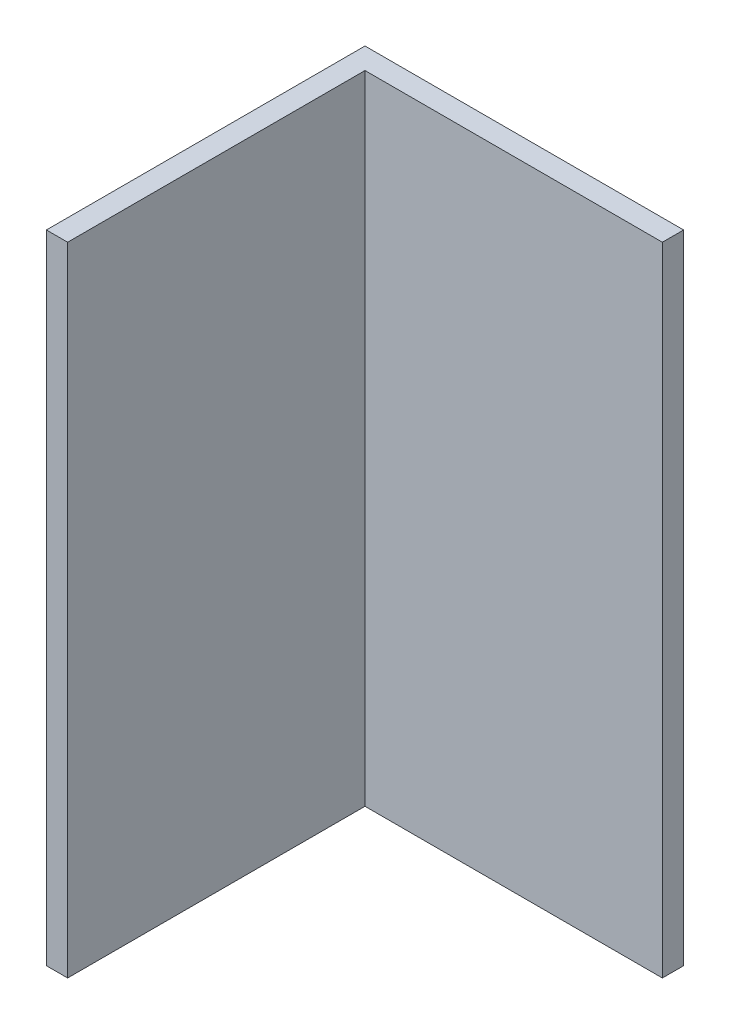
ISO-10303-21;
HEADER;
FILE_DESCRIPTION(('STEP AP214'),'2;1');
FILE_NAME('part.step','',(''),(''),'','','');
FILE_SCHEMA(('AUTOMOTIVE_DESIGN { 1 0 10303 214 1 1 1 1 }'));
ENDSEC;
DATA;
#1=APPLICATION_CONTEXT('core data for automotive mechanical design processes');
#2=APPLICATION_PROTOCOL_DEFINITION('international standard','automotive_design',2000,#1);
#3=PRODUCT_CONTEXT('',#1,'mechanical');
#4=PRODUCT('Part','Part','',(#3));
#5=PRODUCT_RELATED_PRODUCT_CATEGORY('part','',(#4));
#6=PRODUCT_DEFINITION_FORMATION('','',#4);
#7=PRODUCT_DEFINITION_CONTEXT('part definition',#1,'design');
#8=PRODUCT_DEFINITION('design','',#6,#7);
#9=PRODUCT_DEFINITION_SHAPE('','',#8);
#10=(LENGTH_UNIT() NAMED_UNIT(*) SI_UNIT(.MILLI.,.METRE.));
#11=(NAMED_UNIT(*) PLANE_ANGLE_UNIT() SI_UNIT($,.RADIAN.));
#12=(NAMED_UNIT(*) SI_UNIT($,.STERADIAN.) SOLID_ANGLE_UNIT());
#13=UNCERTAINTY_MEASURE_WITH_UNIT(LENGTH_MEASURE(1.E-05),#10,'distance_accuracy_value','');
#14=(GEOMETRIC_REPRESENTATION_CONTEXT(3) GLOBAL_UNCERTAINTY_ASSIGNED_CONTEXT((#13)) GLOBAL_UNIT_ASSIGNED_CONTEXT((#10,
#11,#12)) REPRESENTATION_CONTEXT('',''));
#15=CARTESIAN_POINT('',(0.,0.,0.));
#16=DIRECTION('',(0.,0.,1.));
#17=DIRECTION('',(1.,0.,0.));
#18=AXIS2_PLACEMENT_3D('',#15,#16,#17);
#19=CARTESIAN_POINT('',(0.,60.,0.));
#20=DIRECTION('',(0.,0.,1.));
#21=DIRECTION('',(1.,0.,0.));
#22=AXIS2_PLACEMENT_3D('',#19,#20,#21);
#23=PLANE('',#22);
#24=DIRECTION('',(-1.,0.,0.));
#25=VECTOR('',#24,1.);
#26=CARTESIAN_POINT('',(0.,0.,0.));
#27=LINE('',#26,#25);
#28=CARTESIAN_POINT('',(30.,0.,0.));
#29=VERTEX_POINT('',#28);
#30=CARTESIAN_POINT('',(0.,0.,0.));
#31=VERTEX_POINT('',#30);
#32=EDGE_CURVE('E116',#29,#31,#27,.T.);
#33=ORIENTED_EDGE('',*,*,#32,.T.);
#34=DIRECTION('',(0.,-1.,0.));
#35=VECTOR('',#34,1.);
#36=CARTESIAN_POINT('',(0.,60.,0.));
#37=LINE('',#36,#35);
#38=CARTESIAN_POINT('',(0.,60.,0.));
#39=VERTEX_POINT('',#38);
#40=EDGE_CURVE('E11',#39,#31,#37,.T.);
#41=ORIENTED_EDGE('',*,*,#40,.F.);
#42=DIRECTION('',(-1.,0.,0.));
#43=VECTOR('',#42,1.);
#44=CARTESIAN_POINT('',(0.,60.,0.));
#45=LINE('',#44,#43);
#46=CARTESIAN_POINT('',(30.,60.,0.));
#47=VERTEX_POINT('',#46);
#48=EDGE_CURVE('E126',#47,#39,#45,.T.);
#49=ORIENTED_EDGE('',*,*,#48,.F.);
#50=DIRECTION('',(0.,-1.,0.));
#51=VECTOR('',#50,1.);
#52=CARTESIAN_POINT('',(30.,60.,0.));
#53=LINE('',#52,#51);
#54=EDGE_CURVE('E112',#47,#29,#53,.T.);
#55=ORIENTED_EDGE('',*,*,#54,.T.);
#56=EDGE_LOOP('',(#33,#41,#49,#55));
#57=FACE_BOUND('',#56,.T.);
#58=ADVANCED_FACE('F32',(#57),#23,.F.);
#59=CARTESIAN_POINT('',(0.,60.,0.));
#60=DIRECTION('',(1.,0.,0.));
#61=DIRECTION('',(0.,0.,-1.));
#62=AXIS2_PLACEMENT_3D('',#59,#60,#61);
#63=PLANE('',#62);
#64=DIRECTION('',(0.,0.,1.));
#65=VECTOR('',#64,1.);
#66=CARTESIAN_POINT('',(0.,0.,0.));
#67=LINE('',#66,#65);
#68=CARTESIAN_POINT('',(0.,0.,30.));
#69=VERTEX_POINT('',#68);
#70=EDGE_CURVE('E119',#31,#69,#67,.T.);
#71=ORIENTED_EDGE('',*,*,#70,.T.);
#72=DIRECTION('',(0.,-1.,0.));
#73=VECTOR('',#72,1.);
#74=CARTESIAN_POINT('',(0.,60.,30.));
#75=LINE('',#74,#73);
#76=CARTESIAN_POINT('',(0.,60.,30.));
#77=VERTEX_POINT('',#76);
#78=EDGE_CURVE('E40',#77,#69,#75,.T.);
#79=ORIENTED_EDGE('',*,*,#78,.F.);
#80=DIRECTION('',(0.,0.,1.));
#81=VECTOR('',#80,1.);
#82=CARTESIAN_POINT('',(0.,60.,0.));
#83=LINE('',#82,#81);
#84=EDGE_CURVE('E85',#39,#77,#83,.T.);
#85=ORIENTED_EDGE('',*,*,#84,.F.);
#86=ORIENTED_EDGE('',*,*,#40,.T.);
#87=EDGE_LOOP('',(#71,#79,#85,#86));
#88=FACE_BOUND('',#87,.T.);
#89=ADVANCED_FACE('F150',(#88),#63,.F.);
#90=CARTESIAN_POINT('',(0.,60.,30.));
#91=DIRECTION('',(0.,0.,-1.));
#92=DIRECTION('',(-1.,0.,0.));
#93=AXIS2_PLACEMENT_3D('',#90,#91,#92);
#94=PLANE('',#93);
#95=DIRECTION('',(1.,0.,0.));
#96=VECTOR('',#95,1.);
#97=CARTESIAN_POINT('',(0.,0.,30.));
#98=LINE('',#97,#96);
#99=CARTESIAN_POINT('',(2.,0.,30.));
#100=VERTEX_POINT('',#99);
#101=EDGE_CURVE('E121',#69,#100,#98,.T.);
#102=ORIENTED_EDGE('',*,*,#101,.T.);
#103=DIRECTION('',(0.,-1.,0.));
#104=VECTOR('',#103,1.);
#105=CARTESIAN_POINT('',(2.,60.,30.));
#106=LINE('',#105,#104);
#107=CARTESIAN_POINT('',(2.,60.,30.));
#108=VERTEX_POINT('',#107);
#109=EDGE_CURVE('E107',#108,#100,#106,.T.);
#110=ORIENTED_EDGE('',*,*,#109,.F.);
#111=DIRECTION('',(1.,0.,0.));
#112=VECTOR('',#111,1.);
#113=CARTESIAN_POINT('',(0.,60.,30.));
#114=LINE('',#113,#112);
#115=EDGE_CURVE('E98',#77,#108,#114,.T.);
#116=ORIENTED_EDGE('',*,*,#115,.F.);
#117=ORIENTED_EDGE('',*,*,#78,.T.);
#118=EDGE_LOOP('',(#102,#110,#116,#117));
#119=FACE_BOUND('',#118,.T.);
#120=ADVANCED_FACE('F132',(#119),#94,.F.);
#121=CARTESIAN_POINT('',(2.,60.,2.));
#122=DIRECTION('',(-1.,0.,0.));
#123=DIRECTION('',(0.,0.,1.));
#124=AXIS2_PLACEMENT_3D('',#121,#122,#123);
#125=PLANE('',#124);
#126=DIRECTION('',(0.,0.,-1.));
#127=VECTOR('',#126,1.);
#128=CARTESIAN_POINT('',(2.,0.,2.));
#129=LINE('',#128,#127);
#130=CARTESIAN_POINT('',(2.,0.,2.));
#131=VERTEX_POINT('',#130);
#132=EDGE_CURVE('E106',#100,#131,#129,.T.);
#133=ORIENTED_EDGE('',*,*,#132,.T.);
#134=DIRECTION('',(0.,-1.,0.));
#135=VECTOR('',#134,1.);
#136=CARTESIAN_POINT('',(2.,60.,2.));
#137=LINE('',#136,#135);
#138=CARTESIAN_POINT('',(2.,60.,2.));
#139=VERTEX_POINT('',#138);
#140=EDGE_CURVE('E103',#139,#131,#137,.T.);
#141=ORIENTED_EDGE('',*,*,#140,.F.);
#142=DIRECTION('',(0.,0.,-1.));
#143=VECTOR('',#142,1.);
#144=CARTESIAN_POINT('',(2.,60.,2.));
#145=LINE('',#144,#143);
#146=EDGE_CURVE('E92',#108,#139,#145,.T.);
#147=ORIENTED_EDGE('',*,*,#146,.F.);
#148=ORIENTED_EDGE('',*,*,#109,.T.);
#149=EDGE_LOOP('',(#133,#141,#147,#148));
#150=FACE_BOUND('',#149,.T.);
#151=ADVANCED_FACE('F104',(#150),#125,.F.);
#152=CARTESIAN_POINT('',(2.,60.,2.));
#153=DIRECTION('',(0.,0.,-1.));
#154=DIRECTION('',(-1.,0.,0.));
#155=AXIS2_PLACEMENT_3D('',#152,#153,#154);
#156=PLANE('',#155);
#157=DIRECTION('',(1.,0.,0.));
#158=VECTOR('',#157,1.);
#159=CARTESIAN_POINT('',(2.,0.,2.));
#160=LINE('',#159,#158);
#161=CARTESIAN_POINT('',(30.,0.,2.));
#162=VERTEX_POINT('',#161);
#163=EDGE_CURVE('E71',#131,#162,#160,.T.);
#164=ORIENTED_EDGE('',*,*,#163,.T.);
#165=DIRECTION('',(0.,-1.,0.));
#166=VECTOR('',#165,1.);
#167=CARTESIAN_POINT('',(30.,60.,2.));
#168=LINE('',#167,#166);
#169=CARTESIAN_POINT('',(30.,60.,2.));
#170=VERTEX_POINT('',#169);
#171=EDGE_CURVE('E108',#170,#162,#168,.T.);
#172=ORIENTED_EDGE('',*,*,#171,.F.);
#173=DIRECTION('',(1.,0.,0.));
#174=VECTOR('',#173,1.);
#175=CARTESIAN_POINT('',(2.,60.,2.));
#176=LINE('',#175,#174);
#177=EDGE_CURVE('E96',#139,#170,#176,.T.);
#178=ORIENTED_EDGE('',*,*,#177,.F.);
#179=ORIENTED_EDGE('',*,*,#140,.T.);
#180=EDGE_LOOP('',(#164,#172,#178,#179));
#181=FACE_BOUND('',#180,.T.);
#182=ADVANCED_FACE('F110',(#181),#156,.F.);
#183=CARTESIAN_POINT('',(30.,60.,0.));
#184=DIRECTION('',(-1.,0.,0.));
#185=DIRECTION('',(0.,0.,1.));
#186=AXIS2_PLACEMENT_3D('',#183,#184,#185);
#187=PLANE('',#186);
#188=DIRECTION('',(0.,0.,-1.));
#189=VECTOR('',#188,1.);
#190=CARTESIAN_POINT('',(30.,0.,0.));
#191=LINE('',#190,#189);
#192=EDGE_CURVE('E77',#162,#29,#191,.T.);
#193=ORIENTED_EDGE('',*,*,#192,.T.);
#194=ORIENTED_EDGE('',*,*,#54,.F.);
#195=DIRECTION('',(0.,0.,-1.));
#196=VECTOR('',#195,1.);
#197=CARTESIAN_POINT('',(30.,60.,0.));
#198=LINE('',#197,#196);
#199=EDGE_CURVE('E48',#170,#47,#198,.T.);
#200=ORIENTED_EDGE('',*,*,#199,.F.);
#201=ORIENTED_EDGE('',*,*,#171,.T.);
#202=EDGE_LOOP('',(#193,#194,#200,#201));
#203=FACE_BOUND('',#202,.T.);
#204=ADVANCED_FACE('F139',(#203),#187,.F.);
#205=CARTESIAN_POINT('',(0.,60.,0.));
#206=DIRECTION('',(0.,-1.,0.));
#207=DIRECTION('',(0.,0.,-1.));
#208=AXIS2_PLACEMENT_3D('',#205,#206,#207);
#209=PLANE('',#208);
#210=ORIENTED_EDGE('',*,*,#48,.T.);
#211=ORIENTED_EDGE('',*,*,#84,.T.);
#212=ORIENTED_EDGE('',*,*,#115,.T.);
#213=ORIENTED_EDGE('',*,*,#146,.T.);
#214=ORIENTED_EDGE('',*,*,#177,.T.);
#215=ORIENTED_EDGE('',*,*,#199,.T.);
#216=EDGE_LOOP('',(#210,#211,#212,#213,#214,#215));
#217=FACE_BOUND('',#216,.T.);
#218=ADVANCED_FACE('F94',(#217),#209,.F.);
#219=CARTESIAN_POINT('',(0.,0.,0.));
#220=DIRECTION('',(0.,-1.,0.));
#221=DIRECTION('',(0.,0.,-1.));
#222=AXIS2_PLACEMENT_3D('',#219,#220,#221);
#223=PLANE('',#222);
#224=ORIENTED_EDGE('',*,*,#32,.F.);
#225=ORIENTED_EDGE('',*,*,#192,.F.);
#226=ORIENTED_EDGE('',*,*,#163,.F.);
#227=ORIENTED_EDGE('',*,*,#132,.F.);
#228=ORIENTED_EDGE('',*,*,#101,.F.);
#229=ORIENTED_EDGE('',*,*,#70,.F.);
#230=EDGE_LOOP('',(#224,#225,#226,#227,#228,#229));
#231=FACE_BOUND('',#230,.T.);
#232=ADVANCED_FACE('F135',(#231),#223,.T.);
#233=CLOSED_SHELL('',(#58,#89,#120,#151,#182,#204,#218,#232));
#234=MANIFOLD_SOLID_BREP('B2',#233);
#235=ADVANCED_BREP_SHAPE_REPRESENTATION('',(#18,#234),#14);
#236=SHAPE_DEFINITION_REPRESENTATION(#9,#235);
ENDSEC;
END-ISO-10303-21;
